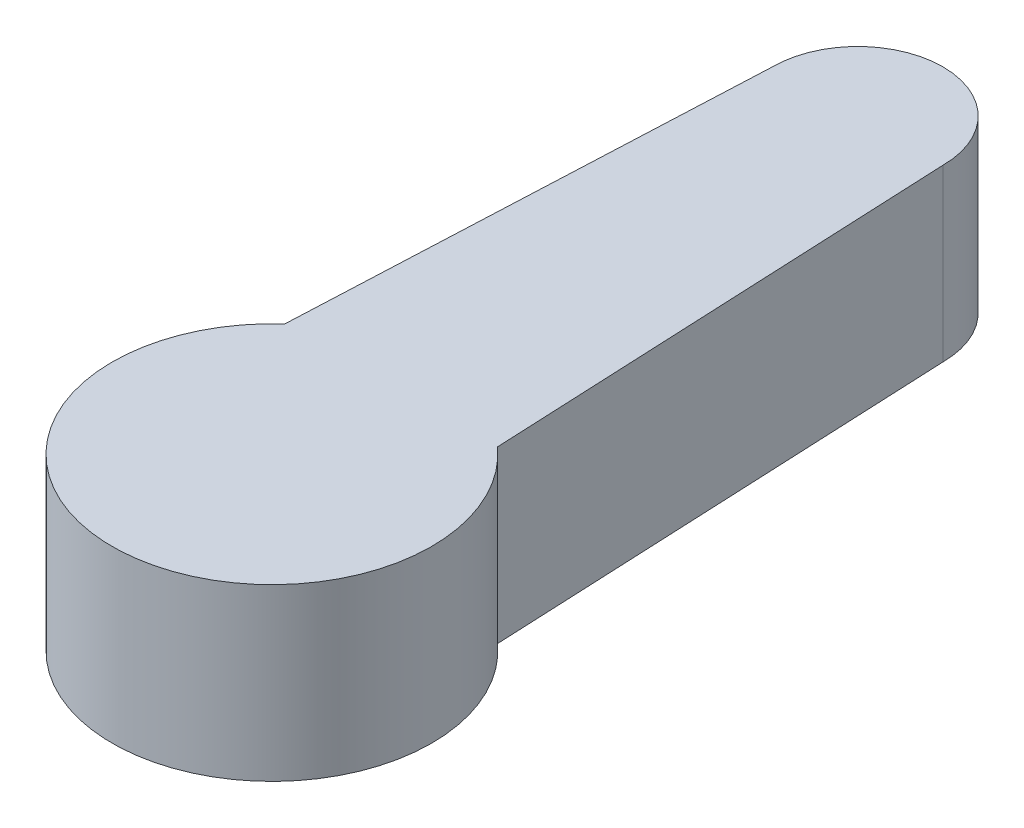
ISO-10303-21;
HEADER;
FILE_DESCRIPTION(('STEP AP214'),'2;1');
FILE_NAME('part.step','',(''),(''),'','','');
FILE_SCHEMA(('AUTOMOTIVE_DESIGN { 1 0 10303 214 1 1 1 1 }'));
ENDSEC;
DATA;
#1=APPLICATION_CONTEXT('core data for automotive mechanical design processes');
#2=APPLICATION_PROTOCOL_DEFINITION('international standard','automotive_design',2000,#1);
#3=PRODUCT_CONTEXT('',#1,'mechanical');
#4=PRODUCT('Part','Part','',(#3));
#5=PRODUCT_RELATED_PRODUCT_CATEGORY('part','',(#4));
#6=PRODUCT_DEFINITION_FORMATION('','',#4);
#7=PRODUCT_DEFINITION_CONTEXT('part definition',#1,'design');
#8=PRODUCT_DEFINITION('design','',#6,#7);
#9=PRODUCT_DEFINITION_SHAPE('','',#8);
#10=(LENGTH_UNIT() NAMED_UNIT(*) SI_UNIT(.MILLI.,.METRE.));
#11=(NAMED_UNIT(*) PLANE_ANGLE_UNIT() SI_UNIT($,.RADIAN.));
#12=(NAMED_UNIT(*) SI_UNIT($,.STERADIAN.) SOLID_ANGLE_UNIT());
#13=UNCERTAINTY_MEASURE_WITH_UNIT(LENGTH_MEASURE(1.E-05),#10,'distance_accuracy_value','');
#14=(GEOMETRIC_REPRESENTATION_CONTEXT(3) GLOBAL_UNCERTAINTY_ASSIGNED_CONTEXT((#13)) GLOBAL_UNIT_ASSIGNED_CONTEXT((#10,
#11,#12)) REPRESENTATION_CONTEXT('',''));
#15=CARTESIAN_POINT('',(0.,0.,0.));
#16=DIRECTION('',(0.,0.,1.));
#17=DIRECTION('',(1.,0.,0.));
#18=AXIS2_PLACEMENT_3D('',#15,#16,#17);
#19=CARTESIAN_POINT('',(2.61958762886598,4.,-0.119072164948454));
#20=DIRECTION('',(0.998968540210299,0.,-0.04540766091865));
#21=DIRECTION('',(-0.04540766091865,0.,-0.9989685402103));
#22=AXIS2_PLACEMENT_3D('',#19,#20,#21);
#23=PLANE('',#22);
#24=DIRECTION('',(0.04540766091865,0.,0.9989685402103));
#25=VECTOR('',#24,1.);
#26=CARTESIAN_POINT('',(2.61958762886598,0.,-0.119072164948454));
#27=LINE('',#26,#25);
#28=CARTESIAN_POINT('',(2.,0.,-13.75));
#29=VERTEX_POINT('',#28);
#30=CARTESIAN_POINT('',(2.49786390523203,0.,-2.79699408489524));
#31=VERTEX_POINT('',#30);
#32=EDGE_CURVE('E101',#29,#31,#27,.T.);
#33=ORIENTED_EDGE('',*,*,#32,.F.);
#34=DIRECTION('',(0.,-1.,0.));
#35=VECTOR('',#34,1.);
#36=CARTESIAN_POINT('',(2.,4.,-13.75));
#37=LINE('',#36,#35);
#38=CARTESIAN_POINT('',(2.,4.,-13.75));
#39=VERTEX_POINT('',#38);
#40=EDGE_CURVE('E11',#39,#29,#37,.T.);
#41=ORIENTED_EDGE('',*,*,#40,.F.);
#42=DIRECTION('',(0.04540766091865,0.,0.9989685402103));
#43=VECTOR('',#42,1.);
#44=CARTESIAN_POINT('',(2.61958762886598,4.,-0.119072164948454));
#45=LINE('',#44,#43);
#46=CARTESIAN_POINT('',(2.49786390523203,4.,-2.79699408489524));
#47=VERTEX_POINT('',#46);
#48=EDGE_CURVE('E89',#39,#47,#45,.T.);
#49=ORIENTED_EDGE('',*,*,#48,.T.);
#50=DIRECTION('',(0.,-1.,0.));
#51=VECTOR('',#50,1.);
#52=CARTESIAN_POINT('',(2.49786390523203,4.,-2.79699408489524));
#53=LINE('',#52,#51);
#54=EDGE_CURVE('E78',#47,#31,#53,.T.);
#55=ORIENTED_EDGE('',*,*,#54,.T.);
#56=EDGE_LOOP('',(#33,#41,#49,#55));
#57=FACE_BOUND('',#56,.T.);
#58=ADVANCED_FACE('F39',(#57),#23,.T.);
#59=CARTESIAN_POINT('',(0.,4.,-13.75));
#60=DIRECTION('',(0.,-1.,0.));
#61=DIRECTION('',(0.,0.,-1.));
#62=AXIS2_PLACEMENT_3D('',#59,#60,#61);
#63=CYLINDRICAL_SURFACE('',#62,2.);
#64=CARTESIAN_POINT('',(0.,0.,-13.75));
#65=DIRECTION('',(0.,1.,0.));
#66=DIRECTION('',(0.,0.,1.));
#67=AXIS2_PLACEMENT_3D('',#64,#65,#66);
#68=CIRCLE('',#67,2.);
#69=CARTESIAN_POINT('',(-2.,0.,-13.75));
#70=VERTEX_POINT('',#69);
#71=EDGE_CURVE('E94',#29,#70,#68,.T.);
#72=ORIENTED_EDGE('',*,*,#71,.T.);
#73=DIRECTION('',(0.,-1.,0.));
#74=VECTOR('',#73,1.);
#75=CARTESIAN_POINT('',(-2.,4.,-13.75));
#76=LINE('',#75,#74);
#77=CARTESIAN_POINT('',(-2.,4.,-13.75));
#78=VERTEX_POINT('',#77);
#79=EDGE_CURVE('E47',#78,#70,#76,.T.);
#80=ORIENTED_EDGE('',*,*,#79,.F.);
#81=CARTESIAN_POINT('',(0.,4.,-13.75));
#82=DIRECTION('',(0.,1.,0.));
#83=DIRECTION('',(0.,0.,1.));
#84=AXIS2_PLACEMENT_3D('',#81,#82,#83);
#85=CIRCLE('',#84,2.);
#86=EDGE_CURVE('E84',#39,#78,#85,.T.);
#87=ORIENTED_EDGE('',*,*,#86,.F.);
#88=ORIENTED_EDGE('',*,*,#40,.T.);
#89=EDGE_LOOP('',(#72,#80,#87,#88));
#90=FACE_BOUND('',#89,.T.);
#91=ADVANCED_FACE('F92',(#90),#63,.T.);
#92=CARTESIAN_POINT('',(-2.61958762886598,4.,-0.119072164948454));
#93=DIRECTION('',(0.998968540210299,0.,0.04540766091865));
#94=DIRECTION('',(0.04540766091865,0.,-0.9989685402103));
#95=AXIS2_PLACEMENT_3D('',#92,#93,#94);
#96=PLANE('',#95);
#97=DIRECTION('',(-0.04540766091865,0.,0.9989685402103));
#98=VECTOR('',#97,1.);
#99=CARTESIAN_POINT('',(-2.61958762886598,0.,-0.119072164948454));
#100=LINE('',#99,#98);
#101=CARTESIAN_POINT('',(-2.49786390523203,0.,-2.79699408489524));
#102=VERTEX_POINT('',#101);
#103=EDGE_CURVE('E71',#70,#102,#100,.T.);
#104=ORIENTED_EDGE('',*,*,#103,.T.);
#105=DIRECTION('',(0.,-1.,0.));
#106=VECTOR('',#105,1.);
#107=CARTESIAN_POINT('',(-2.49786390523203,4.,-2.79699408489524));
#108=LINE('',#107,#106);
#109=CARTESIAN_POINT('',(-2.49786390523203,4.,-2.79699408489524));
#110=VERTEX_POINT('',#109);
#111=EDGE_CURVE('E95',#110,#102,#108,.T.);
#112=ORIENTED_EDGE('',*,*,#111,.F.);
#113=DIRECTION('',(-0.04540766091865,0.,0.9989685402103));
#114=VECTOR('',#113,1.);
#115=CARTESIAN_POINT('',(-2.61958762886598,4.,-0.119072164948454));
#116=LINE('',#115,#114);
#117=EDGE_CURVE('E88',#78,#110,#116,.T.);
#118=ORIENTED_EDGE('',*,*,#117,.F.);
#119=ORIENTED_EDGE('',*,*,#79,.T.);
#120=EDGE_LOOP('',(#104,#112,#118,#119));
#121=FACE_BOUND('',#120,.T.);
#122=ADVANCED_FACE('F96',(#121),#96,.F.);
#123=CARTESIAN_POINT('',(0.,4.,0.));
#124=DIRECTION('',(0.,-1.,0.));
#125=DIRECTION('',(0.,0.,-1.));
#126=AXIS2_PLACEMENT_3D('',#123,#124,#125);
#127=CYLINDRICAL_SURFACE('',#126,3.75);
#128=CARTESIAN_POINT('',(0.,0.,0.));
#129=DIRECTION('',(0.,1.,0.));
#130=DIRECTION('',(0.,0.,1.));
#131=AXIS2_PLACEMENT_3D('',#128,#129,#130);
#132=CIRCLE('',#131,3.75);
#133=EDGE_CURVE('E106',#102,#31,#132,.T.);
#134=ORIENTED_EDGE('',*,*,#133,.T.);
#135=ORIENTED_EDGE('',*,*,#54,.F.);
#136=CARTESIAN_POINT('',(0.,4.,0.));
#137=DIRECTION('',(0.,1.,0.));
#138=DIRECTION('',(0.,0.,1.));
#139=AXIS2_PLACEMENT_3D('',#136,#137,#138);
#140=CIRCLE('',#139,3.75);
#141=EDGE_CURVE('E55',#110,#47,#140,.T.);
#142=ORIENTED_EDGE('',*,*,#141,.F.);
#143=ORIENTED_EDGE('',*,*,#111,.T.);
#144=EDGE_LOOP('',(#134,#135,#142,#143));
#145=FACE_BOUND('',#144,.T.);
#146=ADVANCED_FACE('F111',(#145),#127,.T.);
#147=CARTESIAN_POINT('',(0.,4.,0.));
#148=DIRECTION('',(0.,1.,0.));
#149=DIRECTION('',(0.,0.,1.));
#150=AXIS2_PLACEMENT_3D('',#147,#148,#149);
#151=PLANE('',#150);
#152=ORIENTED_EDGE('',*,*,#48,.F.);
#153=ORIENTED_EDGE('',*,*,#86,.T.);
#154=ORIENTED_EDGE('',*,*,#117,.T.);
#155=ORIENTED_EDGE('',*,*,#141,.T.);
#156=EDGE_LOOP('',(#152,#153,#154,#155));
#157=FACE_BOUND('',#156,.T.);
#158=ADVANCED_FACE('F86',(#157),#151,.T.);
#159=CARTESIAN_POINT('',(0.,0.,0.));
#160=DIRECTION('',(0.,1.,0.));
#161=DIRECTION('',(0.,0.,1.));
#162=AXIS2_PLACEMENT_3D('',#159,#160,#161);
#163=PLANE('',#162);
#164=ORIENTED_EDGE('',*,*,#32,.T.);
#165=ORIENTED_EDGE('',*,*,#133,.F.);
#166=ORIENTED_EDGE('',*,*,#103,.F.);
#167=ORIENTED_EDGE('',*,*,#71,.F.);
#168=EDGE_LOOP('',(#164,#165,#166,#167));
#169=FACE_BOUND('',#168,.T.);
#170=ADVANCED_FACE('F113',(#169),#163,.F.);
#171=CLOSED_SHELL('',(#58,#91,#122,#146,#158,#170));
#172=MANIFOLD_SOLID_BREP('B2',#171);
#173=ADVANCED_BREP_SHAPE_REPRESENTATION('',(#18,#172),#14);
#174=SHAPE_DEFINITION_REPRESENTATION(#9,#173);
ENDSEC;
END-ISO-10303-21;
